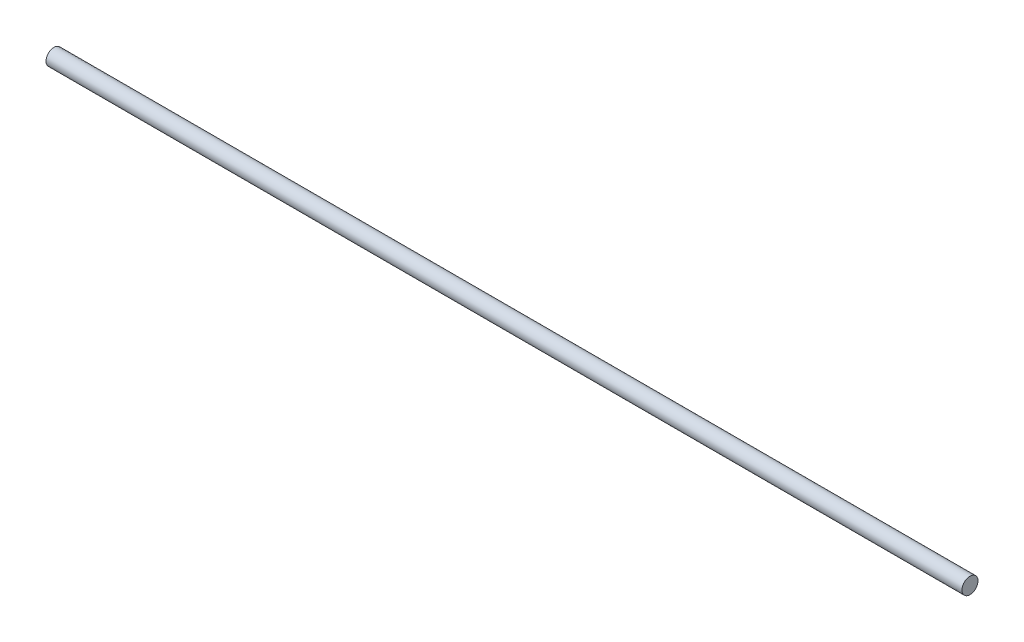
ISO-10303-21;
HEADER;
FILE_DESCRIPTION(('STEP AP214'),'2;1');
FILE_NAME('part.step','',(''),(''),'','','');
FILE_SCHEMA(('AUTOMOTIVE_DESIGN { 1 0 10303 214 1 1 1 1 }'));
ENDSEC;
DATA;
#1=APPLICATION_CONTEXT('core data for automotive mechanical design processes');
#2=APPLICATION_PROTOCOL_DEFINITION('international standard','automotive_design',2000,#1);
#3=PRODUCT_CONTEXT('',#1,'mechanical');
#4=PRODUCT('Part','Part','',(#3));
#5=PRODUCT_RELATED_PRODUCT_CATEGORY('part','',(#4));
#6=PRODUCT_DEFINITION_FORMATION('','',#4);
#7=PRODUCT_DEFINITION_CONTEXT('part definition',#1,'design');
#8=PRODUCT_DEFINITION('design','',#6,#7);
#9=PRODUCT_DEFINITION_SHAPE('','',#8);
#10=(LENGTH_UNIT() NAMED_UNIT(*) SI_UNIT(.MILLI.,.METRE.));
#11=(NAMED_UNIT(*) PLANE_ANGLE_UNIT() SI_UNIT($,.RADIAN.));
#12=(NAMED_UNIT(*) SI_UNIT($,.STERADIAN.) SOLID_ANGLE_UNIT());
#13=UNCERTAINTY_MEASURE_WITH_UNIT(LENGTH_MEASURE(1.E-05),#10,'distance_accuracy_value','');
#14=(GEOMETRIC_REPRESENTATION_CONTEXT(3) GLOBAL_UNCERTAINTY_ASSIGNED_CONTEXT((#13)) GLOBAL_UNIT_ASSIGNED_CONTEXT((#10,
#11,#12)) REPRESENTATION_CONTEXT('',''));
#15=CARTESIAN_POINT('',(0.,0.,0.));
#16=DIRECTION('',(0.,0.,1.));
#17=DIRECTION('',(1.,0.,0.));
#18=AXIS2_PLACEMENT_3D('',#15,#16,#17);
#19=CARTESIAN_POINT('',(101.6,0.,0.));
#20=DIRECTION('',(-1.,0.,0.));
#21=DIRECTION('',(0.,0.,1.));
#22=AXIS2_PLACEMENT_3D('',#19,#20,#21);
#23=CYLINDRICAL_SURFACE('',#22,1.778);
#24=CARTESIAN_POINT('',(101.6,0.,0.));
#25=DIRECTION('',(1.,0.,0.));
#26=DIRECTION('',(0.,0.,-1.));
#27=AXIS2_PLACEMENT_3D('',#24,#25,#26);
#28=CIRCLE('',#27,1.778);
#29=CARTESIAN_POINT('',(101.6,0.,-1.778));
#30=VERTEX_POINT('',#29);
#31=EDGE_CURVE('E10',#30,#30,#28,.T.);
#32=ORIENTED_EDGE('',*,*,#31,.F.);
#33=EDGE_LOOP('',(#32));
#34=FACE_BOUND('',#33,.T.);
#35=CARTESIAN_POINT('',(-101.6,0.,0.));
#36=DIRECTION('',(1.,0.,0.));
#37=DIRECTION('',(0.,0.,-1.));
#38=AXIS2_PLACEMENT_3D('',#35,#36,#37);
#39=CIRCLE('',#38,1.778);
#40=CARTESIAN_POINT('',(-101.6,0.,-1.778));
#41=VERTEX_POINT('',#40);
#42=EDGE_CURVE('E34',#41,#41,#39,.T.);
#43=ORIENTED_EDGE('',*,*,#42,.T.);
#44=EDGE_LOOP('',(#43));
#45=FACE_BOUND('',#44,.T.);
#46=ADVANCED_FACE('F31',(#34,#45),#23,.T.);
#47=CARTESIAN_POINT('',(101.6,0.,0.));
#48=DIRECTION('',(1.,0.,0.));
#49=DIRECTION('',(0.,0.,-1.));
#50=AXIS2_PLACEMENT_3D('',#47,#48,#49);
#51=PLANE('',#50);
#52=ORIENTED_EDGE('',*,*,#31,.T.);
#53=EDGE_LOOP('',(#52));
#54=FACE_BOUND('',#53,.T.);
#55=ADVANCED_FACE('F46',(#54),#51,.T.);
#56=CARTESIAN_POINT('',(-101.6,0.,0.));
#57=DIRECTION('',(1.,0.,0.));
#58=DIRECTION('',(0.,0.,-1.));
#59=AXIS2_PLACEMENT_3D('',#56,#57,#58);
#60=PLANE('',#59);
#61=ORIENTED_EDGE('',*,*,#42,.F.);
#62=EDGE_LOOP('',(#61));
#63=FACE_BOUND('',#62,.T.);
#64=ADVANCED_FACE('F44',(#63),#60,.F.);
#65=CLOSED_SHELL('',(#46,#55,#64));
#66=MANIFOLD_SOLID_BREP('B2',#65);
#67=ADVANCED_BREP_SHAPE_REPRESENTATION('',(#18,#66),#14);
#68=SHAPE_DEFINITION_REPRESENTATION(#9,#67);
ENDSEC;
END-ISO-10303-21;
